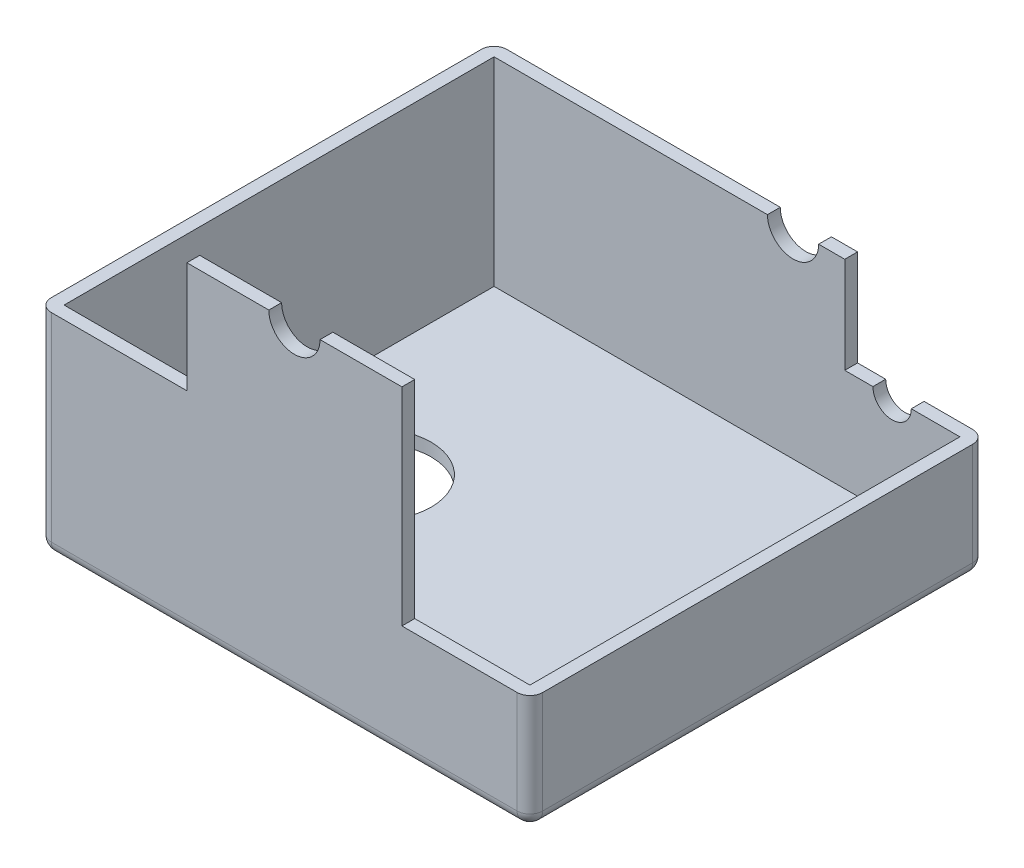
ISO-10303-21;
HEADER;
FILE_DESCRIPTION(('STEP AP214'),'2;1');
FILE_NAME('part.step','',(''),(''),'','','');
FILE_SCHEMA(('AUTOMOTIVE_DESIGN { 1 0 10303 214 1 1 1 1 }'));
ENDSEC;
DATA;
#1=APPLICATION_CONTEXT('core data for automotive mechanical design processes');
#2=APPLICATION_PROTOCOL_DEFINITION('international standard','automotive_design',2000,#1);
#3=PRODUCT_CONTEXT('',#1,'mechanical');
#4=PRODUCT('Part','Part','',(#3));
#5=PRODUCT_RELATED_PRODUCT_CATEGORY('part','',(#4));
#6=PRODUCT_DEFINITION_FORMATION('','',#4);
#7=PRODUCT_DEFINITION_CONTEXT('part definition',#1,'design');
#8=PRODUCT_DEFINITION('design','',#6,#7);
#9=PRODUCT_DEFINITION_SHAPE('','',#8);
#10=(LENGTH_UNIT() NAMED_UNIT(*) SI_UNIT(.MILLI.,.METRE.));
#11=(NAMED_UNIT(*) PLANE_ANGLE_UNIT() SI_UNIT($,.RADIAN.));
#12=(NAMED_UNIT(*) SI_UNIT($,.STERADIAN.) SOLID_ANGLE_UNIT());
#13=UNCERTAINTY_MEASURE_WITH_UNIT(LENGTH_MEASURE(1.E-05),#10,'distance_accuracy_value','');
#14=(GEOMETRIC_REPRESENTATION_CONTEXT(3) GLOBAL_UNCERTAINTY_ASSIGNED_CONTEXT((#13)) GLOBAL_UNIT_ASSIGNED_CONTEXT((#10,
#11,#12)) REPRESENTATION_CONTEXT('',''));
#15=CARTESIAN_POINT('',(0.,0.,0.));
#16=DIRECTION('',(0.,0.,1.));
#17=DIRECTION('',(1.,0.,0.));
#18=AXIS2_PLACEMENT_3D('',#15,#16,#17);
#19=CARTESIAN_POINT('',(29.,63.,86.5));
#20=DIRECTION('',(0.,1.,0.));
#21=DIRECTION('',(0.,0.,1.));
#22=AXIS2_PLACEMENT_3D('',#19,#20,#21);
#23=PLANE('',#22);
#24=DIRECTION('',(0.,0.,1.));
#25=VECTOR('',#24,1.);
#26=CARTESIAN_POINT('',(45.,63.,86.5));
#27=LINE('',#26,#25);
#28=CARTESIAN_POINT('',(45.,63.,86.5));
#29=VERTEX_POINT('',#28);
#30=CARTESIAN_POINT('',(45.,63.,89.));
#31=VERTEX_POINT('',#30);
#32=EDGE_CURVE('E224',#29,#31,#27,.T.);
#33=ORIENTED_EDGE('',*,*,#32,.F.);
#34=DIRECTION('',(-1.,0.,0.));
#35=VECTOR('',#34,1.);
#36=CARTESIAN_POINT('',(29.,63.,86.5));
#37=LINE('',#36,#35);
#38=CARTESIAN_POINT('',(29.,63.,86.5));
#39=VERTEX_POINT('',#38);
#40=EDGE_CURVE('E233',#29,#39,#37,.T.);
#41=ORIENTED_EDGE('',*,*,#40,.T.);
#42=DIRECTION('',(0.,0.,1.));
#43=VECTOR('',#42,1.);
#44=CARTESIAN_POINT('',(29.,63.,86.5));
#45=LINE('',#44,#43);
#46=CARTESIAN_POINT('',(29.,63.,89.));
#47=VERTEX_POINT('',#46);
#48=EDGE_CURVE('E262',#39,#47,#45,.T.);
#49=ORIENTED_EDGE('',*,*,#48,.T.);
#50=DIRECTION('',(-1.,0.,0.));
#51=VECTOR('',#50,1.);
#52=CARTESIAN_POINT('',(29.,63.,89.));
#53=LINE('',#52,#51);
#54=EDGE_CURVE('E253',#31,#47,#53,.T.);
#55=ORIENTED_EDGE('',*,*,#54,.F.);
#56=EDGE_LOOP('',(#33,#41,#49,#55));
#57=FACE_BOUND('',#56,.T.);
#58=ADVANCED_FACE('F40',(#57),#23,.T.);
#59=CARTESIAN_POINT('',(96.,22.55,89.));
#60=DIRECTION('',(0.,-1.,0.));
#61=DIRECTION('',(0.,0.,-1.));
#62=AXIS2_PLACEMENT_3D('',#59,#60,#61);
#63=PLANE('',#62);
#64=DIRECTION('',(-1.,0.,0.));
#65=VECTOR('',#64,1.);
#66=CARTESIAN_POINT('',(93.5,22.55,2.5));
#67=LINE('',#66,#65);
#68=CARTESIAN_POINT('',(76.5,22.55,2.5));
#69=VERTEX_POINT('',#68);
#70=CARTESIAN_POINT('',(71.,22.55,2.5));
#71=VERTEX_POINT('',#70);
#72=EDGE_CURVE('E332',#69,#71,#67,.T.);
#73=ORIENTED_EDGE('',*,*,#72,.F.);
#74=DIRECTION('',(0.,0.,-1.));
#75=VECTOR('',#74,1.);
#76=CARTESIAN_POINT('',(76.5,22.55,10.));
#77=LINE('',#76,#75);
#78=CARTESIAN_POINT('',(76.5,22.55,0.));
#79=VERTEX_POINT('',#78);
#80=EDGE_CURVE('E404',#69,#79,#77,.T.);
#81=ORIENTED_EDGE('',*,*,#80,.T.);
#82=DIRECTION('',(-1.,0.,0.));
#83=VECTOR('',#82,1.);
#84=CARTESIAN_POINT('',(96.,22.55,0.));
#85=LINE('',#84,#83);
#86=CARTESIAN_POINT('',(71.,22.55,0.));
#87=VERTEX_POINT('',#86);
#88=EDGE_CURVE('E281',#79,#87,#85,.T.);
#89=ORIENTED_EDGE('',*,*,#88,.T.);
#90=DIRECTION('',(0.,0.,-1.));
#91=VECTOR('',#90,1.);
#92=CARTESIAN_POINT('',(71.,22.55,89.));
#93=LINE('',#92,#91);
#94=EDGE_CURVE('E316',#71,#87,#93,.T.);
#95=ORIENTED_EDGE('',*,*,#94,.F.);
#96=EDGE_LOOP('',(#73,#81,#89,#95));
#97=FACE_BOUND('',#96,.T.);
#98=ADVANCED_FACE('F544',(#97),#63,.F.);
#99=CARTESIAN_POINT('',(71.,41.34,89.));
#100=DIRECTION('',(0.,-1.,0.));
#101=DIRECTION('',(1.,0.,0.));
#102=AXIS2_PLACEMENT_3D('',#99,#100,#101);
#103=PLANE('',#102);
#104=DIRECTION('',(-1.,0.,0.));
#105=VECTOR('',#104,1.);
#106=CARTESIAN_POINT('',(71.,41.34,0.));
#107=LINE('',#106,#105);
#108=CARTESIAN_POINT('',(55.9,41.34,0.));
#109=VERTEX_POINT('',#108);
#110=CARTESIAN_POINT('',(2.5,41.34,0.));
#111=VERTEX_POINT('',#110);
#112=EDGE_CURVE('E300',#109,#111,#107,.T.);
#113=ORIENTED_EDGE('',*,*,#112,.T.);
#114=CARTESIAN_POINT('',(2.5,41.34,2.5));
#115=DIRECTION('',(0.,-1.,0.));
#116=DIRECTION('',(1.,0.,0.));
#117=AXIS2_PLACEMENT_3D('',#114,#115,#116);
#118=CIRCLE('',#117,2.5);
#119=CARTESIAN_POINT('',(0.,41.34,2.5));
#120=VERTEX_POINT('',#119);
#121=EDGE_CURVE('E430',#111,#120,#118,.F.);
#122=ORIENTED_EDGE('',*,*,#121,.T.);
#123=DIRECTION('',(0.,0.,-1.));
#124=VECTOR('',#123,1.);
#125=CARTESIAN_POINT('',(0.,41.34,89.));
#126=LINE('',#125,#124);
#127=CARTESIAN_POINT('',(0.,41.34,86.5));
#128=VERTEX_POINT('',#127);
#129=EDGE_CURVE('E304',#128,#120,#126,.T.);
#130=ORIENTED_EDGE('',*,*,#129,.F.);
#131=CARTESIAN_POINT('',(2.50000000000001,41.34,86.5));
#132=DIRECTION('',(0.,-1.,0.));
#133=DIRECTION('',(1.,0.,0.));
#134=AXIS2_PLACEMENT_3D('',#131,#132,#133);
#135=CIRCLE('',#134,2.5);
#136=CARTESIAN_POINT('',(2.50000000000002,41.34,89.));
#137=VERTEX_POINT('',#136);
#138=EDGE_CURVE('E427',#128,#137,#135,.F.);
#139=ORIENTED_EDGE('',*,*,#138,.T.);
#140=DIRECTION('',(-1.,0.,0.));
#141=VECTOR('',#140,1.);
#142=CARTESIAN_POINT('',(71.,41.34,89.));
#143=LINE('',#142,#141);
#144=CARTESIAN_POINT('',(29.,41.34,89.));
#145=VERTEX_POINT('',#144);
#146=EDGE_CURVE('E289',#145,#137,#143,.T.);
#147=ORIENTED_EDGE('',*,*,#146,.F.);
#148=DIRECTION('',(0.,0.,1.));
#149=VECTOR('',#148,1.);
#150=CARTESIAN_POINT('',(29.,41.34,86.5));
#151=LINE('',#150,#149);
#152=CARTESIAN_POINT('',(29.,41.34,86.5));
#153=VERTEX_POINT('',#152);
#154=EDGE_CURVE('E257',#153,#145,#151,.T.);
#155=ORIENTED_EDGE('',*,*,#154,.F.);
#156=DIRECTION('',(1.,0.,0.));
#157=VECTOR('',#156,1.);
#158=CARTESIAN_POINT('',(2.50000000000001,41.34,86.5));
#159=LINE('',#158,#157);
#160=CARTESIAN_POINT('',(2.50000000000001,41.34,86.5));
#161=VERTEX_POINT('',#160);
#162=EDGE_CURVE('E308',#161,#153,#159,.T.);
#163=ORIENTED_EDGE('',*,*,#162,.F.);
#164=DIRECTION('',(0.,0.,1.));
#165=VECTOR('',#164,1.);
#166=CARTESIAN_POINT('',(2.5,41.34,2.5));
#167=LINE('',#166,#165);
#168=CARTESIAN_POINT('',(2.5,41.34,2.5));
#169=VERTEX_POINT('',#168);
#170=EDGE_CURVE('E367',#169,#161,#167,.T.);
#171=ORIENTED_EDGE('',*,*,#170,.F.);
#172=DIRECTION('',(-1.,0.,0.));
#173=VECTOR('',#172,1.);
#174=CARTESIAN_POINT('',(93.5,41.34,2.5));
#175=LINE('',#174,#173);
#176=CARTESIAN_POINT('',(55.9,41.34,2.5));
#177=VERTEX_POINT('',#176);
#178=EDGE_CURVE('E323',#177,#169,#175,.T.);
#179=ORIENTED_EDGE('',*,*,#178,.F.);
#180=DIRECTION('',(0.,0.,-1.));
#181=VECTOR('',#180,1.);
#182=CARTESIAN_POINT('',(55.9,41.34,10.));
#183=LINE('',#182,#181);
#184=EDGE_CURVE('E396',#177,#109,#183,.T.);
#185=ORIENTED_EDGE('',*,*,#184,.T.);
#186=EDGE_LOOP('',(#113,#122,#130,#139,#147,#155,#163,#171,#179,#185));
#187=FACE_BOUND('',#186,.T.);
#188=ADVANCED_FACE('F526',(#187),#103,.F.);
#189=CARTESIAN_POINT('',(0.,72.5,0.));
#190=DIRECTION('',(1.,0.,0.));
#191=DIRECTION('',(0.,0.,-1.));
#192=AXIS2_PLACEMENT_3D('',#189,#190,#191);
#193=PLANE('',#192);
#194=ORIENTED_EDGE('',*,*,#129,.T.);
#195=DIRECTION('',(0.,-1.,0.));
#196=VECTOR('',#195,1.);
#197=CARTESIAN_POINT('',(0.,72.5,2.5));
#198=LINE('',#197,#196);
#199=CARTESIAN_POINT('',(0.,2.5,2.5));
#200=VERTEX_POINT('',#199);
#201=EDGE_CURVE('E414',#120,#200,#198,.T.);
#202=ORIENTED_EDGE('',*,*,#201,.T.);
#203=DIRECTION('',(0.,0.,1.));
#204=VECTOR('',#203,1.);
#205=CARTESIAN_POINT('',(0.,2.5,0.));
#206=LINE('',#205,#204);
#207=CARTESIAN_POINT('',(0.,2.5,86.5));
#208=VERTEX_POINT('',#207);
#209=EDGE_CURVE('E411',#200,#208,#206,.T.);
#210=ORIENTED_EDGE('',*,*,#209,.T.);
#211=DIRECTION('',(0.,-1.,0.));
#212=VECTOR('',#211,1.);
#213=CARTESIAN_POINT('',(0.,72.5,86.5));
#214=LINE('',#213,#212);
#215=EDGE_CURVE('E408',#208,#128,#214,.F.);
#216=ORIENTED_EDGE('',*,*,#215,.T.);
#217=EDGE_LOOP('',(#194,#202,#210,#216));
#218=FACE_BOUND('',#217,.T.);
#219=ADVANCED_FACE('F588',(#218),#193,.F.);
#220=CARTESIAN_POINT('',(0.,72.5,89.));
#221=DIRECTION('',(0.,0.,-1.));
#222=DIRECTION('',(-1.,0.,0.));
#223=AXIS2_PLACEMENT_3D('',#220,#221,#222);
#224=PLANE('',#223);
#225=DIRECTION('',(1.,0.,0.));
#226=VECTOR('',#225,1.);
#227=CARTESIAN_POINT('',(0.,2.5,89.));
#228=LINE('',#227,#226);
#229=CARTESIAN_POINT('',(2.50000000000001,2.5,89.));
#230=VERTEX_POINT('',#229);
#231=CARTESIAN_POINT('',(93.5,2.5,89.));
#232=VERTEX_POINT('',#231);
#233=EDGE_CURVE('E50',#230,#232,#228,.T.);
#234=ORIENTED_EDGE('',*,*,#233,.T.);
#235=DIRECTION('',(0.,-1.,0.));
#236=VECTOR('',#235,1.);
#237=CARTESIAN_POINT('',(93.5,72.5,89.));
#238=LINE('',#237,#236);
#239=CARTESIAN_POINT('',(93.5,22.55,89.));
#240=VERTEX_POINT('',#239);
#241=EDGE_CURVE('E11',#232,#240,#238,.F.);
#242=ORIENTED_EDGE('',*,*,#241,.T.);
#243=DIRECTION('',(-1.,0.,0.));
#244=VECTOR('',#243,1.);
#245=CARTESIAN_POINT('',(96.,22.55,89.));
#246=LINE('',#245,#244);
#247=CARTESIAN_POINT('',(71.,22.55,89.));
#248=VERTEX_POINT('',#247);
#249=EDGE_CURVE('E282',#240,#248,#246,.T.);
#250=ORIENTED_EDGE('',*,*,#249,.T.);
#251=DIRECTION('',(0.,1.,0.));
#252=VECTOR('',#251,1.);
#253=CARTESIAN_POINT('',(71.,22.55,89.));
#254=LINE('',#253,#252);
#255=CARTESIAN_POINT('',(71.,63.,89.));
#256=VERTEX_POINT('',#255);
#257=EDGE_CURVE('E285',#248,#256,#254,.T.);
#258=ORIENTED_EDGE('',*,*,#257,.T.);
#259=CARTESIAN_POINT('',(55.,63.,89.));
#260=VERTEX_POINT('',#259);
#261=EDGE_CURVE('E250',#256,#260,#53,.T.);
#262=ORIENTED_EDGE('',*,*,#261,.T.);
#263=CARTESIAN_POINT('',(50.,63.,89.));
#264=DIRECTION('',(0.,0.,1.));
#265=DIRECTION('',(1.,0.,0.));
#266=AXIS2_PLACEMENT_3D('',#263,#264,#265);
#267=CIRCLE('',#266,5.);
#268=EDGE_CURVE('E218',#31,#260,#267,.T.);
#269=ORIENTED_EDGE('',*,*,#268,.F.);
#270=ORIENTED_EDGE('',*,*,#54,.T.);
#271=DIRECTION('',(0.,-1.,0.));
#272=VECTOR('',#271,1.);
#273=CARTESIAN_POINT('',(29.,41.34,89.));
#274=LINE('',#273,#272);
#275=EDGE_CURVE('E247',#47,#145,#274,.T.);
#276=ORIENTED_EDGE('',*,*,#275,.T.);
#277=ORIENTED_EDGE('',*,*,#146,.T.);
#278=DIRECTION('',(0.,-1.,0.));
#279=VECTOR('',#278,1.);
#280=CARTESIAN_POINT('',(2.50000000000001,72.5,89.));
#281=LINE('',#280,#279);
#282=EDGE_CURVE('E61',#137,#230,#281,.T.);
#283=ORIENTED_EDGE('',*,*,#282,.T.);
#284=EDGE_LOOP('',(#234,#242,#250,#258,#262,#269,#270,#276,#277,#283));
#285=FACE_BOUND('',#284,.T.);
#286=ADVANCED_FACE('F518',(#285),#224,.F.);
#287=CARTESIAN_POINT('',(96.,72.5,0.));
#288=DIRECTION('',(-1.,0.,0.));
#289=DIRECTION('',(0.,0.,1.));
#290=AXIS2_PLACEMENT_3D('',#287,#288,#289);
#291=PLANE('',#290);
#292=DIRECTION('',(0.,0.,-1.));
#293=VECTOR('',#292,1.);
#294=CARTESIAN_POINT('',(96.,2.5,0.));
#295=LINE('',#294,#293);
#296=CARTESIAN_POINT('',(96.,2.5,86.5));
#297=VERTEX_POINT('',#296);
#298=CARTESIAN_POINT('',(96.,2.5,2.5));
#299=VERTEX_POINT('',#298);
#300=EDGE_CURVE('E436',#297,#299,#295,.T.);
#301=ORIENTED_EDGE('',*,*,#300,.T.);
#302=DIRECTION('',(0.,-1.,0.));
#303=VECTOR('',#302,1.);
#304=CARTESIAN_POINT('',(96.,72.5,2.5));
#305=LINE('',#304,#303);
#306=CARTESIAN_POINT('',(96.,22.55,2.5));
#307=VERTEX_POINT('',#306);
#308=EDGE_CURVE('E439',#299,#307,#305,.F.);
#309=ORIENTED_EDGE('',*,*,#308,.T.);
#310=DIRECTION('',(0.,0.,-1.));
#311=VECTOR('',#310,1.);
#312=CARTESIAN_POINT('',(96.,22.55,89.));
#313=LINE('',#312,#311);
#314=CARTESIAN_POINT('',(96.,22.55,86.5));
#315=VERTEX_POINT('',#314);
#316=EDGE_CURVE('E292',#315,#307,#313,.T.);
#317=ORIENTED_EDGE('',*,*,#316,.F.);
#318=DIRECTION('',(0.,-1.,0.));
#319=VECTOR('',#318,1.);
#320=CARTESIAN_POINT('',(96.,72.5,86.5));
#321=LINE('',#320,#319);
#322=EDGE_CURVE('E433',#315,#297,#321,.T.);
#323=ORIENTED_EDGE('',*,*,#322,.T.);
#324=EDGE_LOOP('',(#301,#309,#317,#323));
#325=FACE_BOUND('',#324,.T.);
#326=ADVANCED_FACE('F674',(#325),#291,.F.);
#327=CARTESIAN_POINT('',(0.,72.5,0.));
#328=DIRECTION('',(0.,0.,1.));
#329=DIRECTION('',(1.,0.,0.));
#330=AXIS2_PLACEMENT_3D('',#327,#328,#329);
#331=PLANE('',#330);
#332=DIRECTION('',(-1.,0.,0.));
#333=VECTOR('',#332,1.);
#334=CARTESIAN_POINT('',(0.,2.5,0.));
#335=LINE('',#334,#333);
#336=CARTESIAN_POINT('',(93.5,2.5,0.));
#337=VERTEX_POINT('',#336);
#338=CARTESIAN_POINT('',(2.5,2.5,0.));
#339=VERTEX_POINT('',#338);
#340=EDGE_CURVE('E421',#337,#339,#335,.T.);
#341=ORIENTED_EDGE('',*,*,#340,.T.);
#342=DIRECTION('',(0.,-1.,0.));
#343=VECTOR('',#342,1.);
#344=CARTESIAN_POINT('',(2.5,72.5,0.));
#345=LINE('',#344,#343);
#346=EDGE_CURVE('E424',#339,#111,#345,.F.);
#347=ORIENTED_EDGE('',*,*,#346,.T.);
#348=ORIENTED_EDGE('',*,*,#112,.F.);
#349=CARTESIAN_POINT('',(60.9,41.34,0.));
#350=DIRECTION('',(0.,0.,-1.));
#351=DIRECTION('',(-1.,0.,0.));
#352=AXIS2_PLACEMENT_3D('',#349,#350,#351);
#353=CIRCLE('',#352,5.);
#354=CARTESIAN_POINT('',(65.9,41.34,0.));
#355=VERTEX_POINT('',#354);
#356=EDGE_CURVE('E261',#355,#109,#353,.T.);
#357=ORIENTED_EDGE('',*,*,#356,.F.);
#358=CARTESIAN_POINT('',(71.,41.34,0.));
#359=VERTEX_POINT('',#358);
#360=EDGE_CURVE('E286',#359,#355,#107,.T.);
#361=ORIENTED_EDGE('',*,*,#360,.F.);
#362=DIRECTION('',(0.,1.,0.));
#363=VECTOR('',#362,1.);
#364=CARTESIAN_POINT('',(71.,22.55,0.));
#365=LINE('',#364,#363);
#366=EDGE_CURVE('E296',#87,#359,#365,.T.);
#367=ORIENTED_EDGE('',*,*,#366,.F.);
#368=ORIENTED_EDGE('',*,*,#88,.F.);
#369=CARTESIAN_POINT('',(80.25,22.55,0.));
#370=DIRECTION('',(0.,0.,-1.));
#371=DIRECTION('',(-1.,0.,0.));
#372=AXIS2_PLACEMENT_3D('',#369,#370,#371);
#373=CIRCLE('',#372,3.75);
#374=CARTESIAN_POINT('',(84.,22.55,0.));
#375=VERTEX_POINT('',#374);
#376=EDGE_CURVE('E268',#375,#79,#373,.T.);
#377=ORIENTED_EDGE('',*,*,#376,.F.);
#378=CARTESIAN_POINT('',(93.5,22.55,0.));
#379=VERTEX_POINT('',#378);
#380=EDGE_CURVE('E293',#379,#375,#85,.T.);
#381=ORIENTED_EDGE('',*,*,#380,.F.);
#382=DIRECTION('',(0.,-1.,0.));
#383=VECTOR('',#382,1.);
#384=CARTESIAN_POINT('',(93.5,72.5,0.));
#385=LINE('',#384,#383);
#386=EDGE_CURVE('E418',#379,#337,#385,.T.);
#387=ORIENTED_EDGE('',*,*,#386,.T.);
#388=EDGE_LOOP('',(#341,#347,#348,#357,#361,#367,#368,#377,#381,#387));
#389=FACE_BOUND('',#388,.T.);
#390=ADVANCED_FACE('F553',(#389),#331,.F.);
#391=CARTESIAN_POINT('',(0.,0.,0.));
#392=DIRECTION('',(0.,1.,0.));
#393=DIRECTION('',(0.,0.,1.));
#394=AXIS2_PLACEMENT_3D('',#391,#392,#393);
#395=PLANE('',#394);
#396=DIRECTION('',(-1.,0.,0.));
#397=VECTOR('',#396,1.);
#398=CARTESIAN_POINT('',(0.,0.,2.5));
#399=LINE('',#398,#397);
#400=CARTESIAN_POINT('',(2.5,0.,2.5));
#401=VERTEX_POINT('',#400);
#402=CARTESIAN_POINT('',(93.5,0.,2.5));
#403=VERTEX_POINT('',#402);
#404=EDGE_CURVE('E448',#401,#403,#399,.F.);
#405=ORIENTED_EDGE('',*,*,#404,.T.);
#406=DIRECTION('',(0.,0.,-1.));
#407=VECTOR('',#406,1.);
#408=CARTESIAN_POINT('',(93.5,0.,0.));
#409=LINE('',#408,#407);
#410=CARTESIAN_POINT('',(93.5,0.,86.5));
#411=VERTEX_POINT('',#410);
#412=EDGE_CURVE('E451',#403,#411,#409,.F.);
#413=ORIENTED_EDGE('',*,*,#412,.T.);
#414=DIRECTION('',(1.,0.,0.));
#415=VECTOR('',#414,1.);
#416=CARTESIAN_POINT('',(0.,0.,86.5));
#417=LINE('',#416,#415);
#418=CARTESIAN_POINT('',(2.50000000000001,0.,86.5));
#419=VERTEX_POINT('',#418);
#420=EDGE_CURVE('E445',#411,#419,#417,.F.);
#421=ORIENTED_EDGE('',*,*,#420,.T.);
#422=DIRECTION('',(0.,0.,1.));
#423=VECTOR('',#422,1.);
#424=CARTESIAN_POINT('',(2.5,0.,0.));
#425=LINE('',#424,#423);
#426=EDGE_CURVE('E442',#419,#401,#425,.F.);
#427=ORIENTED_EDGE('',*,*,#426,.T.);
#428=EDGE_LOOP('',(#405,#413,#421,#427));
#429=FACE_BOUND('',#428,.T.);
#430=CARTESIAN_POINT('',(22.7,0.,46.));
#431=DIRECTION('',(0.,-1.,0.));
#432=DIRECTION('',(0.,0.,-1.));
#433=AXIS2_PLACEMENT_3D('',#430,#431,#432);
#434=CIRCLE('',#433,11.);
#435=CARTESIAN_POINT('',(22.7,0.,35.));
#436=VERTEX_POINT('',#435);
#437=EDGE_CURVE('E341',#436,#436,#434,.T.);
#438=ORIENTED_EDGE('',*,*,#437,.F.);
#439=EDGE_LOOP('',(#438));
#440=FACE_BOUND('',#439,.T.);
#441=ADVANCED_FACE('F607',(#429,#440),#395,.F.);
#442=CARTESIAN_POINT('',(93.5,2.49999999999999,2.5));
#443=DIRECTION('',(0.,0.,-1.));
#444=DIRECTION('',(-1.,0.,0.));
#445=AXIS2_PLACEMENT_3D('',#442,#443,#444);
#446=PLANE('',#445);
#447=CARTESIAN_POINT('',(93.5,22.55,2.5));
#448=VERTEX_POINT('',#447);
#449=CARTESIAN_POINT('',(84.,22.55,2.5));
#450=VERTEX_POINT('',#449);
#451=EDGE_CURVE('E333',#448,#450,#67,.T.);
#452=ORIENTED_EDGE('',*,*,#451,.T.);
#453=CARTESIAN_POINT('',(80.25,22.55,2.5));
#454=DIRECTION('',(0.,0.,-1.));
#455=DIRECTION('',(-1.,0.,0.));
#456=AXIS2_PLACEMENT_3D('',#453,#454,#455);
#457=CIRCLE('',#456,3.75);
#458=EDGE_CURVE('E277',#450,#69,#457,.T.);
#459=ORIENTED_EDGE('',*,*,#458,.T.);
#460=ORIENTED_EDGE('',*,*,#72,.T.);
#461=DIRECTION('',(0.,1.,0.));
#462=VECTOR('',#461,1.);
#463=CARTESIAN_POINT('',(71.,2.49999999999999,2.5));
#464=LINE('',#463,#462);
#465=CARTESIAN_POINT('',(71.,41.34,2.5));
#466=VERTEX_POINT('',#465);
#467=EDGE_CURVE('E337',#71,#466,#464,.T.);
#468=ORIENTED_EDGE('',*,*,#467,.T.);
#469=CARTESIAN_POINT('',(65.9,41.34,2.5));
#470=VERTEX_POINT('',#469);
#471=EDGE_CURVE('E324',#466,#470,#175,.T.);
#472=ORIENTED_EDGE('',*,*,#471,.T.);
#473=CARTESIAN_POINT('',(60.9,41.34,2.5));
#474=DIRECTION('',(0.,0.,-1.));
#475=DIRECTION('',(-1.,0.,0.));
#476=AXIS2_PLACEMENT_3D('',#473,#474,#475);
#477=CIRCLE('',#476,5.);
#478=EDGE_CURVE('E271',#470,#177,#477,.T.);
#479=ORIENTED_EDGE('',*,*,#478,.T.);
#480=ORIENTED_EDGE('',*,*,#178,.T.);
#481=DIRECTION('',(0.,1.,0.));
#482=VECTOR('',#481,1.);
#483=CARTESIAN_POINT('',(2.5,2.49999999999999,2.5));
#484=LINE('',#483,#482);
#485=CARTESIAN_POINT('',(2.5,2.49999999999999,2.5));
#486=VERTEX_POINT('',#485);
#487=EDGE_CURVE('E362',#486,#169,#484,.T.);
#488=ORIENTED_EDGE('',*,*,#487,.F.);
#489=DIRECTION('',(-1.,0.,0.));
#490=VECTOR('',#489,1.);
#491=CARTESIAN_POINT('',(93.5,2.49999999999999,2.5));
#492=LINE('',#491,#490);
#493=CARTESIAN_POINT('',(93.5,2.49999999999999,2.5));
#494=VERTEX_POINT('',#493);
#495=EDGE_CURVE('E346',#494,#486,#492,.T.);
#496=ORIENTED_EDGE('',*,*,#495,.F.);
#497=DIRECTION('',(0.,1.,0.));
#498=VECTOR('',#497,1.);
#499=CARTESIAN_POINT('',(93.5,2.49999999999999,2.5));
#500=LINE('',#499,#498);
#501=EDGE_CURVE('E363',#494,#448,#500,.T.);
#502=ORIENTED_EDGE('',*,*,#501,.T.);
#503=EDGE_LOOP('',(#452,#459,#460,#468,#472,#479,#480,#488,#496,#502));
#504=FACE_BOUND('',#503,.T.);
#505=ADVANCED_FACE('F557',(#504),#446,.F.);
#506=CARTESIAN_POINT('',(93.5,2.49999999999999,86.5));
#507=DIRECTION('',(1.,0.,0.));
#508=DIRECTION('',(0.,0.,-1.));
#509=AXIS2_PLACEMENT_3D('',#506,#507,#508);
#510=PLANE('',#509);
#511=DIRECTION('',(0.,1.,0.));
#512=VECTOR('',#511,1.);
#513=CARTESIAN_POINT('',(93.5,2.49999999999999,86.5));
#514=LINE('',#513,#512);
#515=CARTESIAN_POINT('',(93.5,2.49999999999999,86.5));
#516=VERTEX_POINT('',#515);
#517=CARTESIAN_POINT('',(93.5,22.55,86.5));
#518=VERTEX_POINT('',#517);
#519=EDGE_CURVE('E368',#516,#518,#514,.T.);
#520=ORIENTED_EDGE('',*,*,#519,.T.);
#521=DIRECTION('',(0.,0.,-1.));
#522=VECTOR('',#521,1.);
#523=CARTESIAN_POINT('',(93.5,22.55,86.5));
#524=LINE('',#523,#522);
#525=EDGE_CURVE('E328',#518,#448,#524,.T.);
#526=ORIENTED_EDGE('',*,*,#525,.T.);
#527=ORIENTED_EDGE('',*,*,#501,.F.);
#528=DIRECTION('',(0.,0.,-1.));
#529=VECTOR('',#528,1.);
#530=CARTESIAN_POINT('',(93.5,2.49999999999999,86.5));
#531=LINE('',#530,#529);
#532=EDGE_CURVE('E358',#516,#494,#531,.T.);
#533=ORIENTED_EDGE('',*,*,#532,.F.);
#534=EDGE_LOOP('',(#520,#526,#527,#533));
#535=FACE_BOUND('',#534,.T.);
#536=ADVANCED_FACE('F660',(#535),#510,.F.);
#537=CARTESIAN_POINT('',(2.50000000000001,2.49999999999999,86.5));
#538=DIRECTION('',(0.,0.,1.));
#539=DIRECTION('',(1.,0.,0.));
#540=AXIS2_PLACEMENT_3D('',#537,#538,#539);
#541=PLANE('',#540);
#542=ORIENTED_EDGE('',*,*,#40,.F.);
#543=CARTESIAN_POINT('',(50.,63.,86.5));
#544=DIRECTION('',(0.,0.,1.));
#545=DIRECTION('',(1.,0.,0.));
#546=AXIS2_PLACEMENT_3D('',#543,#544,#545);
#547=CIRCLE('',#546,5.);
#548=CARTESIAN_POINT('',(55.,63.,86.5));
#549=VERTEX_POINT('',#548);
#550=EDGE_CURVE('E215',#29,#549,#547,.T.);
#551=ORIENTED_EDGE('',*,*,#550,.T.);
#552=CARTESIAN_POINT('',(71.,63.,86.5));
#553=VERTEX_POINT('',#552);
#554=EDGE_CURVE('E231',#553,#549,#37,.T.);
#555=ORIENTED_EDGE('',*,*,#554,.F.);
#556=DIRECTION('',(0.,-1.,0.));
#557=VECTOR('',#556,1.);
#558=CARTESIAN_POINT('',(71.,2.49999999999999,86.5));
#559=LINE('',#558,#557);
#560=CARTESIAN_POINT('',(71.,22.55,86.5));
#561=VERTEX_POINT('',#560);
#562=EDGE_CURVE('E389',#553,#561,#559,.T.);
#563=ORIENTED_EDGE('',*,*,#562,.T.);
#564=DIRECTION('',(1.,0.,0.));
#565=VECTOR('',#564,1.);
#566=CARTESIAN_POINT('',(2.50000000000001,22.55,86.5));
#567=LINE('',#566,#565);
#568=EDGE_CURVE('E385',#561,#518,#567,.T.);
#569=ORIENTED_EDGE('',*,*,#568,.T.);
#570=ORIENTED_EDGE('',*,*,#519,.F.);
#571=DIRECTION('',(1.,0.,0.));
#572=VECTOR('',#571,1.);
#573=CARTESIAN_POINT('',(2.50000000000001,2.49999999999999,86.5));
#574=LINE('',#573,#572);
#575=CARTESIAN_POINT('',(2.50000000000001,2.49999999999999,86.5));
#576=VERTEX_POINT('',#575);
#577=EDGE_CURVE('E354',#576,#516,#574,.T.);
#578=ORIENTED_EDGE('',*,*,#577,.F.);
#579=DIRECTION('',(0.,1.,0.));
#580=VECTOR('',#579,1.);
#581=CARTESIAN_POINT('',(2.50000000000001,2.49999999999999,86.5));
#582=LINE('',#581,#580);
#583=EDGE_CURVE('E372',#576,#161,#582,.T.);
#584=ORIENTED_EDGE('',*,*,#583,.T.);
#585=ORIENTED_EDGE('',*,*,#162,.T.);
#586=DIRECTION('',(0.,-1.,0.));
#587=VECTOR('',#586,1.);
#588=CARTESIAN_POINT('',(29.,41.34,86.5));
#589=LINE('',#588,#587);
#590=EDGE_CURVE('E241',#39,#153,#589,.T.);
#591=ORIENTED_EDGE('',*,*,#590,.F.);
#592=EDGE_LOOP('',(#542,#551,#555,#563,#569,#570,#578,#584,#585,#591));
#593=FACE_BOUND('',#592,.T.);
#594=ADVANCED_FACE('F229',(#593),#541,.F.);
#595=CARTESIAN_POINT('',(2.5,2.49999999999999,2.5));
#596=DIRECTION('',(-1.,0.,0.));
#597=DIRECTION('',(0.,0.,1.));
#598=AXIS2_PLACEMENT_3D('',#595,#596,#597);
#599=PLANE('',#598);
#600=ORIENTED_EDGE('',*,*,#487,.T.);
#601=ORIENTED_EDGE('',*,*,#170,.T.);
#602=ORIENTED_EDGE('',*,*,#583,.F.);
#603=DIRECTION('',(0.,0.,1.));
#604=VECTOR('',#603,1.);
#605=CARTESIAN_POINT('',(2.5,2.49999999999999,2.5));
#606=LINE('',#605,#604);
#607=EDGE_CURVE('E350',#486,#576,#606,.T.);
#608=ORIENTED_EDGE('',*,*,#607,.F.);
#609=EDGE_LOOP('',(#600,#601,#602,#608));
#610=FACE_BOUND('',#609,.T.);
#611=ADVANCED_FACE('F531',(#610),#599,.F.);
#612=CARTESIAN_POINT('',(0.,2.49999999999999,0.));
#613=DIRECTION('',(0.,1.,0.));
#614=DIRECTION('',(0.,0.,1.));
#615=AXIS2_PLACEMENT_3D('',#612,#613,#614);
#616=PLANE('',#615);
#617=CARTESIAN_POINT('',(22.7,2.49999999999999,46.));
#618=DIRECTION('',(0.,1.,0.));
#619=DIRECTION('',(0.,0.,1.));
#620=AXIS2_PLACEMENT_3D('',#617,#618,#619);
#621=CIRCLE('',#620,11.);
#622=CARTESIAN_POINT('',(22.7,2.49999999999999,57.));
#623=VERTEX_POINT('',#622);
#624=EDGE_CURVE('E345',#623,#623,#621,.T.);
#625=ORIENTED_EDGE('',*,*,#624,.F.);
#626=EDGE_LOOP('',(#625));
#627=FACE_BOUND('',#626,.T.);
#628=ORIENTED_EDGE('',*,*,#495,.T.);
#629=ORIENTED_EDGE('',*,*,#607,.T.);
#630=ORIENTED_EDGE('',*,*,#577,.T.);
#631=ORIENTED_EDGE('',*,*,#532,.T.);
#632=EDGE_LOOP('',(#628,#629,#630,#631));
#633=FACE_BOUND('',#632,.T.);
#634=ADVANCED_FACE('F655',(#627,#633),#616,.T.);
#635=CARTESIAN_POINT('',(22.7,10.,46.));
#636=DIRECTION('',(0.,-1.,0.));
#637=DIRECTION('',(0.,0.,-1.));
#638=AXIS2_PLACEMENT_3D('',#635,#636,#637);
#639=CYLINDRICAL_SURFACE('',#638,11.);
#640=ORIENTED_EDGE('',*,*,#624,.T.);
#641=EDGE_LOOP('',(#640));
#642=FACE_BOUND('',#641,.T.);
#643=ORIENTED_EDGE('',*,*,#437,.T.);
#644=EDGE_LOOP('',(#643));
#645=FACE_BOUND('',#644,.T.);
#646=ADVANCED_FACE('F650',(#642,#645),#639,.F.);
#647=CARTESIAN_POINT('',(71.,22.55,89.));
#648=DIRECTION('',(-1.,0.,0.));
#649=DIRECTION('',(0.,0.,1.));
#650=AXIS2_PLACEMENT_3D('',#647,#648,#649);
#651=PLANE('',#650);
#652=ORIENTED_EDGE('',*,*,#94,.T.);
#653=ORIENTED_EDGE('',*,*,#366,.T.);
#654=DIRECTION('',(0.,0.,-1.));
#655=VECTOR('',#654,1.);
#656=CARTESIAN_POINT('',(71.,41.34,89.));
#657=LINE('',#656,#655);
#658=EDGE_CURVE('E309',#466,#359,#657,.T.);
#659=ORIENTED_EDGE('',*,*,#658,.F.);
#660=ORIENTED_EDGE('',*,*,#467,.F.);
#661=EDGE_LOOP('',(#652,#653,#659,#660));
#662=FACE_BOUND('',#661,.T.);
#663=ADVANCED_FACE('F550',(#662),#651,.F.);
#664=ORIENTED_EDGE('',*,*,#562,.F.);
#665=DIRECTION('',(0.,0.,1.));
#666=VECTOR('',#665,1.);
#667=CARTESIAN_POINT('',(71.,63.,86.5));
#668=LINE('',#667,#666);
#669=EDGE_CURVE('E239',#553,#256,#668,.T.);
#670=ORIENTED_EDGE('',*,*,#669,.T.);
#671=ORIENTED_EDGE('',*,*,#257,.F.);
#672=EDGE_CURVE('E312',#248,#561,#93,.T.);
#673=ORIENTED_EDGE('',*,*,#672,.T.);
#674=EDGE_LOOP('',(#664,#670,#671,#673));
#675=FACE_BOUND('',#674,.T.);
#676=ADVANCED_FACE('F649',(#675),#651,.F.);
#677=ORIENTED_EDGE('',*,*,#316,.T.);
#678=CARTESIAN_POINT('',(93.5,22.55,2.5));
#679=DIRECTION('',(0.,-1.,0.));
#680=DIRECTION('',(0.,0.,-1.));
#681=AXIS2_PLACEMENT_3D('',#678,#679,#680);
#682=CIRCLE('',#681,2.5);
#683=EDGE_CURVE('E458',#307,#379,#682,.F.);
#684=ORIENTED_EDGE('',*,*,#683,.T.);
#685=ORIENTED_EDGE('',*,*,#380,.T.);
#686=DIRECTION('',(0.,0.,-1.));
#687=VECTOR('',#686,1.);
#688=CARTESIAN_POINT('',(84.,22.55,10.));
#689=LINE('',#688,#687);
#690=EDGE_CURVE('E400',#375,#450,#689,.F.);
#691=ORIENTED_EDGE('',*,*,#690,.T.);
#692=ORIENTED_EDGE('',*,*,#451,.F.);
#693=ORIENTED_EDGE('',*,*,#525,.F.);
#694=ORIENTED_EDGE('',*,*,#568,.F.);
#695=ORIENTED_EDGE('',*,*,#672,.F.);
#696=ORIENTED_EDGE('',*,*,#249,.F.);
#697=CARTESIAN_POINT('',(93.5,22.55,86.5));
#698=DIRECTION('',(0.,-1.,0.));
#699=DIRECTION('',(0.,0.,-1.));
#700=AXIS2_PLACEMENT_3D('',#697,#698,#699);
#701=CIRCLE('',#700,2.5);
#702=EDGE_CURVE('E455',#240,#315,#701,.F.);
#703=ORIENTED_EDGE('',*,*,#702,.T.);
#704=EDGE_LOOP('',(#677,#684,#685,#691,#692,#693,#694,#695,#696,#703));
#705=FACE_BOUND('',#704,.T.);
#706=ADVANCED_FACE('F563',(#705),#63,.F.);
#707=ORIENTED_EDGE('',*,*,#360,.T.);
#708=DIRECTION('',(0.,0.,-1.));
#709=VECTOR('',#708,1.);
#710=CARTESIAN_POINT('',(65.9,41.34,10.));
#711=LINE('',#710,#709);
#712=EDGE_CURVE('E392',#355,#470,#711,.F.);
#713=ORIENTED_EDGE('',*,*,#712,.T.);
#714=ORIENTED_EDGE('',*,*,#471,.F.);
#715=ORIENTED_EDGE('',*,*,#658,.T.);
#716=EDGE_LOOP('',(#707,#713,#714,#715));
#717=FACE_BOUND('',#716,.T.);
#718=ADVANCED_FACE('F556',(#717),#103,.F.);
#719=CARTESIAN_POINT('',(60.9,41.34,10.));
#720=DIRECTION('',(0.,0.,-1.));
#721=DIRECTION('',(-1.,0.,0.));
#722=AXIS2_PLACEMENT_3D('',#719,#720,#721);
#723=CYLINDRICAL_SURFACE('',#722,5.);
#724=ORIENTED_EDGE('',*,*,#712,.F.);
#725=ORIENTED_EDGE('',*,*,#356,.T.);
#726=ORIENTED_EDGE('',*,*,#184,.F.);
#727=ORIENTED_EDGE('',*,*,#478,.F.);
#728=EDGE_LOOP('',(#724,#725,#726,#727));
#729=FACE_BOUND('',#728,.T.);
#730=ADVANCED_FACE('F639',(#729),#723,.F.);
#731=CARTESIAN_POINT('',(80.25,22.55,10.));
#732=DIRECTION('',(0.,0.,-1.));
#733=DIRECTION('',(-1.,0.,0.));
#734=AXIS2_PLACEMENT_3D('',#731,#732,#733);
#735=CYLINDRICAL_SURFACE('',#734,3.75);
#736=ORIENTED_EDGE('',*,*,#690,.F.);
#737=ORIENTED_EDGE('',*,*,#376,.T.);
#738=ORIENTED_EDGE('',*,*,#80,.F.);
#739=ORIENTED_EDGE('',*,*,#458,.F.);
#740=EDGE_LOOP('',(#736,#737,#738,#739));
#741=FACE_BOUND('',#740,.T.);
#742=ADVANCED_FACE('F561',(#741),#735,.F.);
#743=CARTESIAN_POINT('',(29.,41.34,86.5));
#744=DIRECTION('',(-1.,0.,0.));
#745=DIRECTION('',(0.,-1.,0.));
#746=AXIS2_PLACEMENT_3D('',#743,#744,#745);
#747=PLANE('',#746);
#748=ORIENTED_EDGE('',*,*,#275,.F.);
#749=ORIENTED_EDGE('',*,*,#48,.F.);
#750=ORIENTED_EDGE('',*,*,#590,.T.);
#751=ORIENTED_EDGE('',*,*,#154,.T.);
#752=EDGE_LOOP('',(#748,#749,#750,#751));
#753=FACE_BOUND('',#752,.T.);
#754=ADVANCED_FACE('F523',(#753),#747,.T.);
#755=DIRECTION('',(0.,0.,1.));
#756=VECTOR('',#755,1.);
#757=CARTESIAN_POINT('',(55.,63.,86.5));
#758=LINE('',#757,#756);
#759=EDGE_CURVE('E212',#549,#260,#758,.T.);
#760=ORIENTED_EDGE('',*,*,#759,.T.);
#761=ORIENTED_EDGE('',*,*,#261,.F.);
#762=ORIENTED_EDGE('',*,*,#669,.F.);
#763=ORIENTED_EDGE('',*,*,#554,.T.);
#764=EDGE_LOOP('',(#760,#761,#762,#763));
#765=FACE_BOUND('',#764,.T.);
#766=ADVANCED_FACE('F237',(#765),#23,.T.);
#767=CARTESIAN_POINT('',(50.,63.,86.5));
#768=DIRECTION('',(0.,0.,1.));
#769=DIRECTION('',(1.,0.,0.));
#770=AXIS2_PLACEMENT_3D('',#767,#768,#769);
#771=CYLINDRICAL_SURFACE('',#770,5.);
#772=ORIENTED_EDGE('',*,*,#268,.T.);
#773=ORIENTED_EDGE('',*,*,#759,.F.);
#774=ORIENTED_EDGE('',*,*,#550,.F.);
#775=ORIENTED_EDGE('',*,*,#32,.T.);
#776=EDGE_LOOP('',(#772,#773,#774,#775));
#777=FACE_BOUND('',#776,.T.);
#778=ADVANCED_FACE('F214',(#777),#771,.F.);
#779=CARTESIAN_POINT('',(93.5,72.5,86.5));
#780=DIRECTION('',(0.,-1.,0.));
#781=DIRECTION('',(0.,0.,-1.));
#782=AXIS2_PLACEMENT_3D('',#779,#780,#781);
#783=CYLINDRICAL_SURFACE('',#782,2.5);
#784=CARTESIAN_POINT('',(93.5,2.5,86.5));
#785=DIRECTION('',(0.,-1.,0.));
#786=DIRECTION('',(0.,0.,-1.));
#787=AXIS2_PLACEMENT_3D('',#784,#785,#786);
#788=CIRCLE('',#787,2.5);
#789=EDGE_CURVE('E44',#297,#232,#788,.T.);
#790=ORIENTED_EDGE('',*,*,#789,.F.);
#791=ORIENTED_EDGE('',*,*,#322,.F.);
#792=ORIENTED_EDGE('',*,*,#702,.F.);
#793=ORIENTED_EDGE('',*,*,#241,.F.);
#794=EDGE_LOOP('',(#790,#791,#792,#793));
#795=FACE_BOUND('',#794,.T.);
#796=ADVANCED_FACE('F42',(#795),#783,.T.);
#797=CARTESIAN_POINT('',(93.5,2.5,86.5));
#798=DIRECTION('',(0.,0.,1.));
#799=DIRECTION('',(1.,0.,0.));
#800=AXIS2_PLACEMENT_3D('',#797,#798,#799);
#801=SPHERICAL_SURFACE('',#800,2.5);
#802=CARTESIAN_POINT('',(93.5,2.5,86.5));
#803=DIRECTION('',(0.,0.,1.));
#804=DIRECTION('',(1.,0.,0.));
#805=AXIS2_PLACEMENT_3D('',#802,#803,#804);
#806=CIRCLE('',#805,2.5);
#807=EDGE_CURVE('E500',#297,#411,#806,.F.);
#808=ORIENTED_EDGE('',*,*,#807,.F.);
#809=ORIENTED_EDGE('',*,*,#789,.T.);
#810=CARTESIAN_POINT('',(93.5,2.5,86.5));
#811=DIRECTION('',(1.,0.,0.));
#812=DIRECTION('',(0.,0.,-1.));
#813=AXIS2_PLACEMENT_3D('',#810,#811,#812);
#814=CIRCLE('',#813,2.5);
#815=EDGE_CURVE('E503',#411,#232,#814,.F.);
#816=ORIENTED_EDGE('',*,*,#815,.F.);
#817=EDGE_LOOP('',(#808,#809,#816));
#818=FACE_BOUND('',#817,.T.);
#819=ADVANCED_FACE('F602',(#818),#801,.T.);
#820=CARTESIAN_POINT('',(2.50000000000001,72.5,86.5));
#821=DIRECTION('',(0.,-1.,0.));
#822=DIRECTION('',(0.,0.,-1.));
#823=AXIS2_PLACEMENT_3D('',#820,#821,#822);
#824=CYLINDRICAL_SURFACE('',#823,2.5);
#825=ORIENTED_EDGE('',*,*,#138,.F.);
#826=ORIENTED_EDGE('',*,*,#215,.F.);
#827=CARTESIAN_POINT('',(2.50000000000001,2.5,86.5));
#828=DIRECTION('',(0.,-1.,0.));
#829=DIRECTION('',(0.,0.,-1.));
#830=AXIS2_PLACEMENT_3D('',#827,#828,#829);
#831=CIRCLE('',#830,2.5);
#832=EDGE_CURVE('E496',#230,#208,#831,.T.);
#833=ORIENTED_EDGE('',*,*,#832,.F.);
#834=ORIENTED_EDGE('',*,*,#282,.F.);
#835=EDGE_LOOP('',(#825,#826,#833,#834));
#836=FACE_BOUND('',#835,.T.);
#837=ADVANCED_FACE('F593',(#836),#824,.T.);
#838=CARTESIAN_POINT('',(0.,2.5,86.5));
#839=DIRECTION('',(1.,0.,0.));
#840=DIRECTION('',(0.,0.,-1.));
#841=AXIS2_PLACEMENT_3D('',#838,#839,#840);
#842=CYLINDRICAL_SURFACE('',#841,2.5);
#843=ORIENTED_EDGE('',*,*,#815,.T.);
#844=ORIENTED_EDGE('',*,*,#233,.F.);
#845=CARTESIAN_POINT('',(2.50000000000001,2.5,86.5));
#846=DIRECTION('',(-1.,0.,0.));
#847=DIRECTION('',(0.,0.,1.));
#848=AXIS2_PLACEMENT_3D('',#845,#846,#847);
#849=CIRCLE('',#848,2.5);
#850=EDGE_CURVE('E492',#419,#230,#849,.T.);
#851=ORIENTED_EDGE('',*,*,#850,.F.);
#852=ORIENTED_EDGE('',*,*,#420,.F.);
#853=EDGE_LOOP('',(#843,#844,#851,#852));
#854=FACE_BOUND('',#853,.T.);
#855=ADVANCED_FACE('F600',(#854),#842,.T.);
#856=CARTESIAN_POINT('',(93.5,2.5,0.));
#857=DIRECTION('',(0.,0.,-1.));
#858=DIRECTION('',(-1.,0.,0.));
#859=AXIS2_PLACEMENT_3D('',#856,#857,#858);
#860=CYLINDRICAL_SURFACE('',#859,2.5);
#861=ORIENTED_EDGE('',*,*,#807,.T.);
#862=ORIENTED_EDGE('',*,*,#412,.F.);
#863=CARTESIAN_POINT('',(93.5,2.5,2.5));
#864=DIRECTION('',(0.,0.,-1.));
#865=DIRECTION('',(-1.,0.,0.));
#866=AXIS2_PLACEMENT_3D('',#863,#864,#865);
#867=CIRCLE('',#866,2.5);
#868=EDGE_CURVE('E488',#299,#403,#867,.T.);
#869=ORIENTED_EDGE('',*,*,#868,.F.);
#870=ORIENTED_EDGE('',*,*,#300,.F.);
#871=EDGE_LOOP('',(#861,#862,#869,#870));
#872=FACE_BOUND('',#871,.T.);
#873=ADVANCED_FACE('F606',(#872),#860,.T.);
#874=CARTESIAN_POINT('',(93.5,72.5,2.5));
#875=DIRECTION('',(0.,-1.,0.));
#876=DIRECTION('',(0.,0.,-1.));
#877=AXIS2_PLACEMENT_3D('',#874,#875,#876);
#878=CYLINDRICAL_SURFACE('',#877,2.5);
#879=ORIENTED_EDGE('',*,*,#683,.F.);
#880=ORIENTED_EDGE('',*,*,#308,.F.);
#881=CARTESIAN_POINT('',(93.5,2.5,2.5));
#882=DIRECTION('',(0.,-1.,0.));
#883=DIRECTION('',(0.,0.,-1.));
#884=AXIS2_PLACEMENT_3D('',#881,#882,#883);
#885=CIRCLE('',#884,2.5);
#886=EDGE_CURVE('E484',#337,#299,#885,.T.);
#887=ORIENTED_EDGE('',*,*,#886,.F.);
#888=ORIENTED_EDGE('',*,*,#386,.F.);
#889=EDGE_LOOP('',(#879,#880,#887,#888));
#890=FACE_BOUND('',#889,.T.);
#891=ADVANCED_FACE('F569',(#890),#878,.T.);
#892=CARTESIAN_POINT('',(2.50000000000001,2.5,86.5));
#893=DIRECTION('',(0.,0.,1.));
#894=DIRECTION('',(1.,0.,0.));
#895=AXIS2_PLACEMENT_3D('',#892,#893,#894);
#896=SPHERICAL_SURFACE('',#895,2.5);
#897=ORIENTED_EDGE('',*,*,#850,.T.);
#898=ORIENTED_EDGE('',*,*,#832,.T.);
#899=CARTESIAN_POINT('',(2.50000000000001,2.5,86.5));
#900=DIRECTION('',(0.,0.,1.));
#901=DIRECTION('',(1.,0.,0.));
#902=AXIS2_PLACEMENT_3D('',#899,#900,#901);
#903=CIRCLE('',#902,2.5);
#904=EDGE_CURVE('E480',#419,#208,#903,.F.);
#905=ORIENTED_EDGE('',*,*,#904,.F.);
#906=EDGE_LOOP('',(#897,#898,#905));
#907=FACE_BOUND('',#906,.T.);
#908=ADVANCED_FACE('F598',(#907),#896,.T.);
#909=CARTESIAN_POINT('',(93.5,2.5,2.5));
#910=DIRECTION('',(0.,0.,1.));
#911=DIRECTION('',(1.,0.,0.));
#912=AXIS2_PLACEMENT_3D('',#909,#910,#911);
#913=SPHERICAL_SURFACE('',#912,2.5);
#914=ORIENTED_EDGE('',*,*,#886,.T.);
#915=ORIENTED_EDGE('',*,*,#868,.T.);
#916=CARTESIAN_POINT('',(93.5,2.5,2.5));
#917=DIRECTION('',(1.,0.,0.));
#918=DIRECTION('',(0.,0.,-1.));
#919=AXIS2_PLACEMENT_3D('',#916,#917,#918);
#920=CIRCLE('',#919,2.5);
#921=EDGE_CURVE('E476',#337,#403,#920,.F.);
#922=ORIENTED_EDGE('',*,*,#921,.F.);
#923=EDGE_LOOP('',(#914,#915,#922));
#924=FACE_BOUND('',#923,.T.);
#925=ADVANCED_FACE('F575',(#924),#913,.T.);
#926=CARTESIAN_POINT('',(2.5,2.5,0.));
#927=DIRECTION('',(0.,0.,1.));
#928=DIRECTION('',(1.,0.,0.));
#929=AXIS2_PLACEMENT_3D('',#926,#927,#928);
#930=CYLINDRICAL_SURFACE('',#929,2.5);
#931=ORIENTED_EDGE('',*,*,#904,.T.);
#932=ORIENTED_EDGE('',*,*,#209,.F.);
#933=CARTESIAN_POINT('',(2.5,2.5,2.5));
#934=DIRECTION('',(0.,0.,-1.));
#935=DIRECTION('',(-1.,0.,0.));
#936=AXIS2_PLACEMENT_3D('',#933,#934,#935);
#937=CIRCLE('',#936,2.5);
#938=EDGE_CURVE('E472',#401,#200,#937,.T.);
#939=ORIENTED_EDGE('',*,*,#938,.F.);
#940=ORIENTED_EDGE('',*,*,#426,.F.);
#941=EDGE_LOOP('',(#931,#932,#939,#940));
#942=FACE_BOUND('',#941,.T.);
#943=ADVANCED_FACE('F611',(#942),#930,.T.);
#944=CARTESIAN_POINT('',(0.,2.5,2.5));
#945=DIRECTION('',(-1.,0.,0.));
#946=DIRECTION('',(0.,0.,1.));
#947=AXIS2_PLACEMENT_3D('',#944,#945,#946);
#948=CYLINDRICAL_SURFACE('',#947,2.5);
#949=ORIENTED_EDGE('',*,*,#921,.T.);
#950=ORIENTED_EDGE('',*,*,#404,.F.);
#951=CARTESIAN_POINT('',(2.5,2.5,2.5));
#952=DIRECTION('',(-1.,0.,0.));
#953=DIRECTION('',(0.,0.,1.));
#954=AXIS2_PLACEMENT_3D('',#951,#952,#953);
#955=CIRCLE('',#954,2.5);
#956=EDGE_CURVE('E468',#339,#401,#955,.T.);
#957=ORIENTED_EDGE('',*,*,#956,.F.);
#958=ORIENTED_EDGE('',*,*,#340,.F.);
#959=EDGE_LOOP('',(#949,#950,#957,#958));
#960=FACE_BOUND('',#959,.T.);
#961=ADVANCED_FACE('F579',(#960),#948,.T.);
#962=CARTESIAN_POINT('',(2.5,2.5,2.5));
#963=DIRECTION('',(0.,0.,1.));
#964=DIRECTION('',(1.,0.,0.));
#965=AXIS2_PLACEMENT_3D('',#962,#963,#964);
#966=SPHERICAL_SURFACE('',#965,2.5);
#967=ORIENTED_EDGE('',*,*,#956,.T.);
#968=ORIENTED_EDGE('',*,*,#938,.T.);
#969=CARTESIAN_POINT('',(2.5,2.5,2.5));
#970=DIRECTION('',(0.,-1.,0.));
#971=DIRECTION('',(0.,0.,-1.));
#972=AXIS2_PLACEMENT_3D('',#969,#970,#971);
#973=CIRCLE('',#972,2.5);
#974=EDGE_CURVE('E465',#339,#200,#973,.F.);
#975=ORIENTED_EDGE('',*,*,#974,.F.);
#976=EDGE_LOOP('',(#967,#968,#975));
#977=FACE_BOUND('',#976,.T.);
#978=ADVANCED_FACE('F613',(#977),#966,.T.);
#979=CARTESIAN_POINT('',(2.5,72.5,2.5));
#980=DIRECTION('',(0.,-1.,0.));
#981=DIRECTION('',(0.,0.,-1.));
#982=AXIS2_PLACEMENT_3D('',#979,#980,#981);
#983=CYLINDRICAL_SURFACE('',#982,2.5);
#984=ORIENTED_EDGE('',*,*,#121,.F.);
#985=ORIENTED_EDGE('',*,*,#346,.F.);
#986=ORIENTED_EDGE('',*,*,#974,.T.);
#987=ORIENTED_EDGE('',*,*,#201,.F.);
#988=EDGE_LOOP('',(#984,#985,#986,#987));
#989=FACE_BOUND('',#988,.T.);
#990=ADVANCED_FACE('F586',(#989),#983,.T.);
#991=CLOSED_SHELL('',(#58,#98,#188,#219,#286,#326,#390,#441,#505,#536,#594,#611,#634,#646,#663,
#676,#706,#718,#730,#742,#754,#766,#778,#796,#819,#837,#855,#873,#891,#908,#925,#943,#961,#978,#990));
#992=MANIFOLD_SOLID_BREP('B2',#991);
#993=ADVANCED_BREP_SHAPE_REPRESENTATION('',(#18,#992),#14);
#994=SHAPE_DEFINITION_REPRESENTATION(#9,#993);
ENDSEC;
END-ISO-10303-21;
